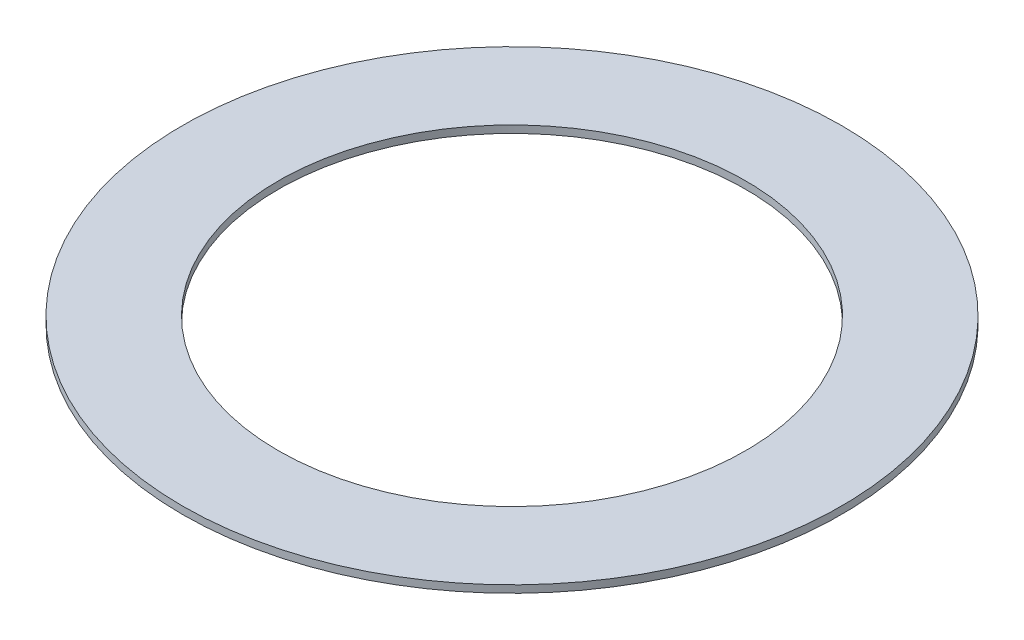
ISO-10303-21;
HEADER;
FILE_DESCRIPTION(('STEP AP214'),'2;1');
FILE_NAME('part.step','',(''),(''),'','','');
FILE_SCHEMA(('AUTOMOTIVE_DESIGN { 1 0 10303 214 1 1 1 1 }'));
ENDSEC;
DATA;
#1=APPLICATION_CONTEXT('core data for automotive mechanical design processes');
#2=APPLICATION_PROTOCOL_DEFINITION('international standard','automotive_design',2000,#1);
#3=PRODUCT_CONTEXT('',#1,'mechanical');
#4=PRODUCT('Part','Part','',(#3));
#5=PRODUCT_RELATED_PRODUCT_CATEGORY('part','',(#4));
#6=PRODUCT_DEFINITION_FORMATION('','',#4);
#7=PRODUCT_DEFINITION_CONTEXT('part definition',#1,'design');
#8=PRODUCT_DEFINITION('design','',#6,#7);
#9=PRODUCT_DEFINITION_SHAPE('','',#8);
#10=(LENGTH_UNIT() NAMED_UNIT(*) SI_UNIT(.MILLI.,.METRE.));
#11=(NAMED_UNIT(*) PLANE_ANGLE_UNIT() SI_UNIT($,.RADIAN.));
#12=(NAMED_UNIT(*) SI_UNIT($,.STERADIAN.) SOLID_ANGLE_UNIT());
#13=UNCERTAINTY_MEASURE_WITH_UNIT(LENGTH_MEASURE(1.E-05),#10,'distance_accuracy_value','');
#14=(GEOMETRIC_REPRESENTATION_CONTEXT(3) GLOBAL_UNCERTAINTY_ASSIGNED_CONTEXT((#13)) GLOBAL_UNIT_ASSIGNED_CONTEXT((#10,
#11,#12)) REPRESENTATION_CONTEXT('',''));
#15=CARTESIAN_POINT('',(0.,0.,0.));
#16=DIRECTION('',(0.,0.,1.));
#17=DIRECTION('',(1.,0.,0.));
#18=AXIS2_PLACEMENT_3D('',#15,#16,#17);
#19=CARTESIAN_POINT('',(0.,2.4,0.));
#20=DIRECTION('',(0.,1.,0.));
#21=DIRECTION('',(0.,0.,1.));
#22=AXIS2_PLACEMENT_3D('',#19,#20,#21);
#23=PLANE('',#22);
#24=CARTESIAN_POINT('',(0.,2.4,0.));
#25=DIRECTION('',(0.,1.,0.));
#26=DIRECTION('',(0.,0.,1.));
#27=AXIS2_PLACEMENT_3D('',#24,#25,#26);
#28=CIRCLE('',#27,107.442);
#29=CARTESIAN_POINT('',(0.,2.4,107.442));
#30=VERTEX_POINT('',#29);
#31=EDGE_CURVE('E10',#30,#30,#28,.T.);
#32=ORIENTED_EDGE('',*,*,#31,.T.);
#33=EDGE_LOOP('',(#32));
#34=FACE_BOUND('',#33,.T.);
#35=CARTESIAN_POINT('',(0.,2.4,0.));
#36=DIRECTION('',(0.,1.,0.));
#37=DIRECTION('',(0.,0.,1.));
#38=AXIS2_PLACEMENT_3D('',#35,#36,#37);
#39=CIRCLE('',#38,76.2);
#40=CARTESIAN_POINT('',(0.,2.4,76.2));
#41=VERTEX_POINT('',#40);
#42=EDGE_CURVE('E43',#41,#41,#39,.T.);
#43=ORIENTED_EDGE('',*,*,#42,.F.);
#44=EDGE_LOOP('',(#43));
#45=FACE_BOUND('',#44,.T.);
#46=ADVANCED_FACE('F32',(#34,#45),#23,.T.);
#47=CARTESIAN_POINT('',(0.,0.,0.));
#48=DIRECTION('',(0.,1.,0.));
#49=DIRECTION('',(0.,0.,1.));
#50=AXIS2_PLACEMENT_3D('',#47,#48,#49);
#51=PLANE('',#50);
#52=CARTESIAN_POINT('',(0.,0.,0.));
#53=DIRECTION('',(0.,1.,0.));
#54=DIRECTION('',(0.,0.,1.));
#55=AXIS2_PLACEMENT_3D('',#52,#53,#54);
#56=CIRCLE('',#55,107.442);
#57=CARTESIAN_POINT('',(0.,0.,107.442));
#58=VERTEX_POINT('',#57);
#59=EDGE_CURVE('E36',#58,#58,#56,.T.);
#60=ORIENTED_EDGE('',*,*,#59,.F.);
#61=EDGE_LOOP('',(#60));
#62=FACE_BOUND('',#61,.T.);
#63=CARTESIAN_POINT('',(0.,0.,0.));
#64=DIRECTION('',(0.,1.,0.));
#65=DIRECTION('',(0.,0.,1.));
#66=AXIS2_PLACEMENT_3D('',#63,#64,#65);
#67=CIRCLE('',#66,76.2);
#68=CARTESIAN_POINT('',(0.,0.,76.2));
#69=VERTEX_POINT('',#68);
#70=EDGE_CURVE('E45',#69,#69,#67,.T.);
#71=ORIENTED_EDGE('',*,*,#70,.T.);
#72=EDGE_LOOP('',(#71));
#73=FACE_BOUND('',#72,.T.);
#74=ADVANCED_FACE('F55',(#62,#73),#51,.F.);
#75=CARTESIAN_POINT('',(0.,2.4,0.));
#76=DIRECTION('',(0.,-1.,0.));
#77=DIRECTION('',(0.,0.,-1.));
#78=AXIS2_PLACEMENT_3D('',#75,#76,#77);
#79=CYLINDRICAL_SURFACE('',#78,107.442);
#80=ORIENTED_EDGE('',*,*,#31,.F.);
#81=EDGE_LOOP('',(#80));
#82=FACE_BOUND('',#81,.T.);
#83=ORIENTED_EDGE('',*,*,#59,.T.);
#84=EDGE_LOOP('',(#83));
#85=FACE_BOUND('',#84,.T.);
#86=ADVANCED_FACE('F34',(#82,#85),#79,.T.);
#87=CARTESIAN_POINT('',(0.,2.4,0.));
#88=DIRECTION('',(0.,-1.,0.));
#89=DIRECTION('',(0.,0.,-1.));
#90=AXIS2_PLACEMENT_3D('',#87,#88,#89);
#91=CYLINDRICAL_SURFACE('',#90,76.2);
#92=ORIENTED_EDGE('',*,*,#42,.T.);
#93=EDGE_LOOP('',(#92));
#94=FACE_BOUND('',#93,.T.);
#95=ORIENTED_EDGE('',*,*,#70,.F.);
#96=EDGE_LOOP('',(#95));
#97=FACE_BOUND('',#96,.T.);
#98=ADVANCED_FACE('F51',(#94,#97),#91,.F.);
#99=CLOSED_SHELL('',(#46,#74,#86,#98));
#100=MANIFOLD_SOLID_BREP('B2',#99);
#101=ADVANCED_BREP_SHAPE_REPRESENTATION('',(#18,#100),#14);
#102=SHAPE_DEFINITION_REPRESENTATION(#9,#101);
ENDSEC;
END-ISO-10303-21;
